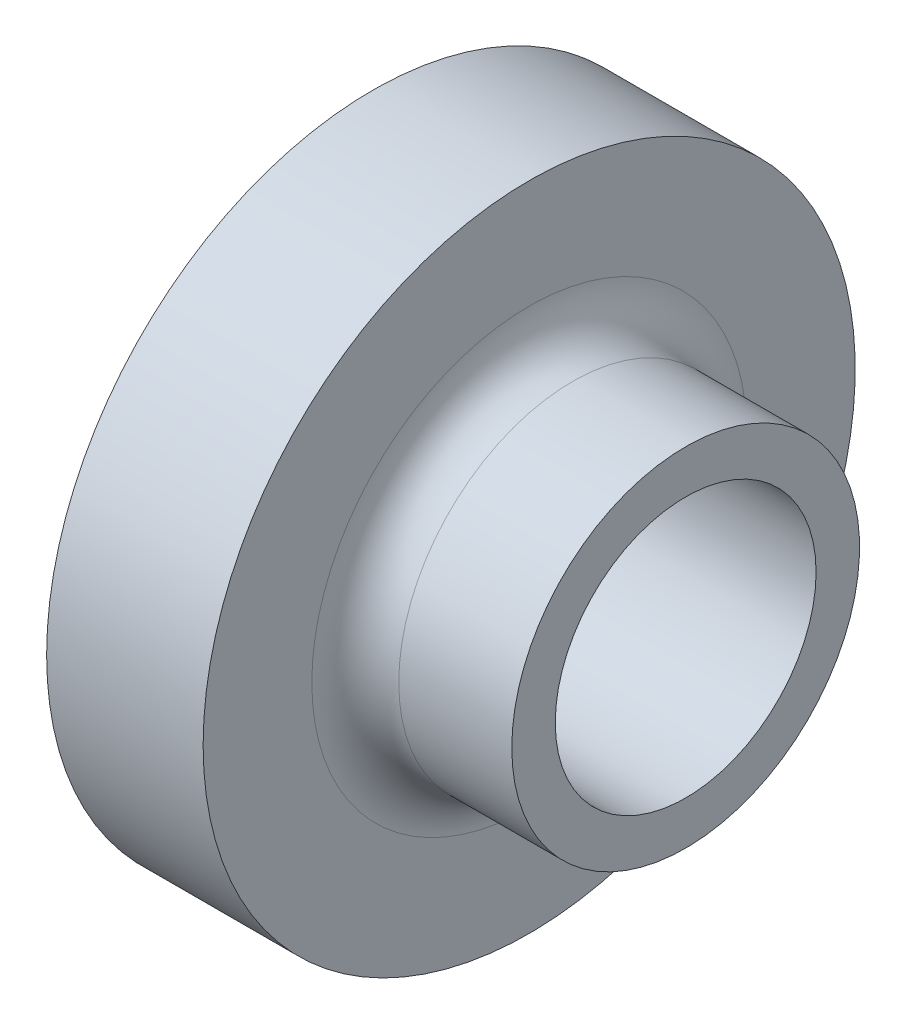
ISO-10303-21;
HEADER;
FILE_DESCRIPTION(('STEP AP214'),'2;1');
FILE_NAME('part.step','',(''),(''),'','','');
FILE_SCHEMA(('AUTOMOTIVE_DESIGN { 1 0 10303 214 1 1 1 1 }'));
ENDSEC;
DATA;
#1=APPLICATION_CONTEXT('core data for automotive mechanical design processes');
#2=APPLICATION_PROTOCOL_DEFINITION('international standard','automotive_design',2000,#1);
#3=PRODUCT_CONTEXT('',#1,'mechanical');
#4=PRODUCT('Part','Part','',(#3));
#5=PRODUCT_RELATED_PRODUCT_CATEGORY('part','',(#4));
#6=PRODUCT_DEFINITION_FORMATION('','',#4);
#7=PRODUCT_DEFINITION_CONTEXT('part definition',#1,'design');
#8=PRODUCT_DEFINITION('design','',#6,#7);
#9=PRODUCT_DEFINITION_SHAPE('','',#8);
#10=(LENGTH_UNIT() NAMED_UNIT(*) SI_UNIT(.MILLI.,.METRE.));
#11=(NAMED_UNIT(*) PLANE_ANGLE_UNIT() SI_UNIT($,.RADIAN.));
#12=(NAMED_UNIT(*) SI_UNIT($,.STERADIAN.) SOLID_ANGLE_UNIT());
#13=UNCERTAINTY_MEASURE_WITH_UNIT(LENGTH_MEASURE(1.E-05),#10,'distance_accuracy_value','');
#14=(GEOMETRIC_REPRESENTATION_CONTEXT(3) GLOBAL_UNCERTAINTY_ASSIGNED_CONTEXT((#13)) GLOBAL_UNIT_ASSIGNED_CONTEXT((#10,
#11,#12)) REPRESENTATION_CONTEXT('',''));
#15=CARTESIAN_POINT('',(0.,0.,0.));
#16=DIRECTION('',(0.,0.,1.));
#17=DIRECTION('',(1.,0.,0.));
#18=AXIS2_PLACEMENT_3D('',#15,#16,#17);
#19=CARTESIAN_POINT('',(0.,15.,0.));
#20=DIRECTION('',(1.,0.,0.));
#21=DIRECTION('',(0.,0.,-1.));
#22=AXIS2_PLACEMENT_3D('',#19,#20,#21);
#23=PLANE('',#22);
#24=CARTESIAN_POINT('',(0.,0.,0.));
#25=DIRECTION('',(-1.,0.,0.));
#26=DIRECTION('',(0.,0.,1.));
#27=AXIS2_PLACEMENT_3D('',#24,#25,#26);
#28=CIRCLE('',#27,15.);
#29=CARTESIAN_POINT('',(0.,0.,15.));
#30=VERTEX_POINT('',#29);
#31=EDGE_CURVE('E58',#30,#30,#28,.T.);
#32=ORIENTED_EDGE('',*,*,#31,.F.);
#33=EDGE_LOOP('',(#32));
#34=FACE_BOUND('',#33,.T.);
#35=CARTESIAN_POINT('',(0.,0.,0.));
#36=DIRECTION('',(-1.,0.,0.));
#37=DIRECTION('',(0.,0.,1.));
#38=AXIS2_PLACEMENT_3D('',#35,#36,#37);
#39=CIRCLE('',#38,37.5);
#40=CARTESIAN_POINT('',(0.,0.,37.5));
#41=VERTEX_POINT('',#40);
#42=EDGE_CURVE('E43',#41,#41,#39,.T.);
#43=ORIENTED_EDGE('',*,*,#42,.T.);
#44=EDGE_LOOP('',(#43));
#45=FACE_BOUND('',#44,.T.);
#46=ADVANCED_FACE('F32',(#34,#45),#23,.F.);
#47=CARTESIAN_POINT('',(0.,0.,0.));
#48=DIRECTION('',(-1.,0.,0.));
#49=DIRECTION('',(0.,0.,1.));
#50=AXIS2_PLACEMENT_3D('',#47,#48,#49);
#51=CYLINDRICAL_SURFACE('',#50,37.5);
#52=ORIENTED_EDGE('',*,*,#42,.F.);
#53=EDGE_LOOP('',(#52));
#54=FACE_BOUND('',#53,.T.);
#55=CARTESIAN_POINT('',(18.,0.,0.));
#56=DIRECTION('',(-1.,0.,0.));
#57=DIRECTION('',(0.,0.,1.));
#58=AXIS2_PLACEMENT_3D('',#55,#56,#57);
#59=CIRCLE('',#58,37.5);
#60=CARTESIAN_POINT('',(18.,0.,37.5));
#61=VERTEX_POINT('',#60);
#62=EDGE_CURVE('E47',#61,#61,#59,.T.);
#63=ORIENTED_EDGE('',*,*,#62,.T.);
#64=EDGE_LOOP('',(#63));
#65=FACE_BOUND('',#64,.T.);
#66=ADVANCED_FACE('F66',(#54,#65),#51,.T.);
#67=CARTESIAN_POINT('',(18.,37.5,0.));
#68=DIRECTION('',(-1.,0.,0.));
#69=DIRECTION('',(0.,0.,1.));
#70=AXIS2_PLACEMENT_3D('',#67,#68,#69);
#71=PLANE('',#70);
#72=CARTESIAN_POINT('',(18.,0.,0.));
#73=DIRECTION('',(-1.,0.,0.));
#74=DIRECTION('',(0.,0.,1.));
#75=AXIS2_PLACEMENT_3D('',#72,#73,#74);
#76=CIRCLE('',#75,25.);
#77=CARTESIAN_POINT('',(18.,0.,25.));
#78=VERTEX_POINT('',#77);
#79=EDGE_CURVE('E39',#78,#78,#76,.T.);
#80=ORIENTED_EDGE('',*,*,#79,.T.);
#81=EDGE_LOOP('',(#80));
#82=FACE_BOUND('',#81,.T.);
#83=ORIENTED_EDGE('',*,*,#62,.F.);
#84=EDGE_LOOP('',(#83));
#85=FACE_BOUND('',#84,.T.);
#86=ADVANCED_FACE('F71',(#82,#85),#71,.F.);
#87=CARTESIAN_POINT('',(0.,0.,0.));
#88=DIRECTION('',(-1.,0.,0.));
#89=DIRECTION('',(0.,0.,1.));
#90=AXIS2_PLACEMENT_3D('',#87,#88,#89);
#91=CYLINDRICAL_SURFACE('',#90,20.);
#92=CARTESIAN_POINT('',(23.,0.,0.));
#93=DIRECTION('',(-1.,0.,0.));
#94=DIRECTION('',(0.,0.,1.));
#95=AXIS2_PLACEMENT_3D('',#92,#93,#94);
#96=CIRCLE('',#95,20.);
#97=CARTESIAN_POINT('',(23.,0.,20.));
#98=VERTEX_POINT('',#97);
#99=EDGE_CURVE('E10',#98,#98,#96,.F.);
#100=ORIENTED_EDGE('',*,*,#99,.T.);
#101=EDGE_LOOP('',(#100));
#102=FACE_BOUND('',#101,.T.);
#103=CARTESIAN_POINT('',(36.,0.,0.));
#104=DIRECTION('',(-1.,0.,0.));
#105=DIRECTION('',(0.,0.,1.));
#106=AXIS2_PLACEMENT_3D('',#103,#104,#105);
#107=CIRCLE('',#106,20.);
#108=CARTESIAN_POINT('',(36.,0.,20.));
#109=VERTEX_POINT('',#108);
#110=EDGE_CURVE('E52',#109,#109,#107,.T.);
#111=ORIENTED_EDGE('',*,*,#110,.T.);
#112=EDGE_LOOP('',(#111));
#113=FACE_BOUND('',#112,.T.);
#114=ADVANCED_FACE('F76',(#102,#113),#91,.T.);
#115=CARTESIAN_POINT('',(36.,20.,0.));
#116=DIRECTION('',(-1.,0.,0.));
#117=DIRECTION('',(0.,0.,1.));
#118=AXIS2_PLACEMENT_3D('',#115,#116,#117);
#119=PLANE('',#118);
#120=ORIENTED_EDGE('',*,*,#110,.F.);
#121=EDGE_LOOP('',(#120));
#122=FACE_BOUND('',#121,.T.);
#123=CARTESIAN_POINT('',(36.,0.,0.));
#124=DIRECTION('',(-1.,0.,0.));
#125=DIRECTION('',(0.,0.,1.));
#126=AXIS2_PLACEMENT_3D('',#123,#124,#125);
#127=CIRCLE('',#126,15.);
#128=CARTESIAN_POINT('',(36.,0.,15.));
#129=VERTEX_POINT('',#128);
#130=EDGE_CURVE('E55',#129,#129,#127,.T.);
#131=ORIENTED_EDGE('',*,*,#130,.T.);
#132=EDGE_LOOP('',(#131));
#133=FACE_BOUND('',#132,.T.);
#134=ADVANCED_FACE('F81',(#122,#133),#119,.F.);
#135=CARTESIAN_POINT('',(0.,0.,0.));
#136=DIRECTION('',(-1.,0.,0.));
#137=DIRECTION('',(0.,0.,1.));
#138=AXIS2_PLACEMENT_3D('',#135,#136,#137);
#139=CYLINDRICAL_SURFACE('',#138,15.);
#140=ORIENTED_EDGE('',*,*,#130,.F.);
#141=EDGE_LOOP('',(#140));
#142=FACE_BOUND('',#141,.T.);
#143=ORIENTED_EDGE('',*,*,#31,.T.);
#144=EDGE_LOOP('',(#143));
#145=FACE_BOUND('',#144,.T.);
#146=ADVANCED_FACE('F62',(#142,#145),#139,.F.);
#147=CARTESIAN_POINT('',(23.,0.,0.));
#148=DIRECTION('',(-1.,0.,0.));
#149=DIRECTION('',(0.,0.,1.));
#150=AXIS2_PLACEMENT_3D('',#147,#148,#149);
#151=TOROIDAL_SURFACE('',#150,25.,5.);
#152=ORIENTED_EDGE('',*,*,#99,.F.);
#153=EDGE_LOOP('',(#152));
#154=FACE_BOUND('',#153,.T.);
#155=ORIENTED_EDGE('',*,*,#79,.F.);
#156=EDGE_LOOP('',(#155));
#157=FACE_BOUND('',#156,.T.);
#158=ADVANCED_FACE('F34',(#154,#157),#151,.F.);
#159=CLOSED_SHELL('',(#46,#66,#86,#114,#134,#146,#158));
#160=MANIFOLD_SOLID_BREP('B2',#159);
#161=ADVANCED_BREP_SHAPE_REPRESENTATION('',(#18,#160),#14);
#162=SHAPE_DEFINITION_REPRESENTATION(#9,#161);
ENDSEC;
END-ISO-10303-21;
